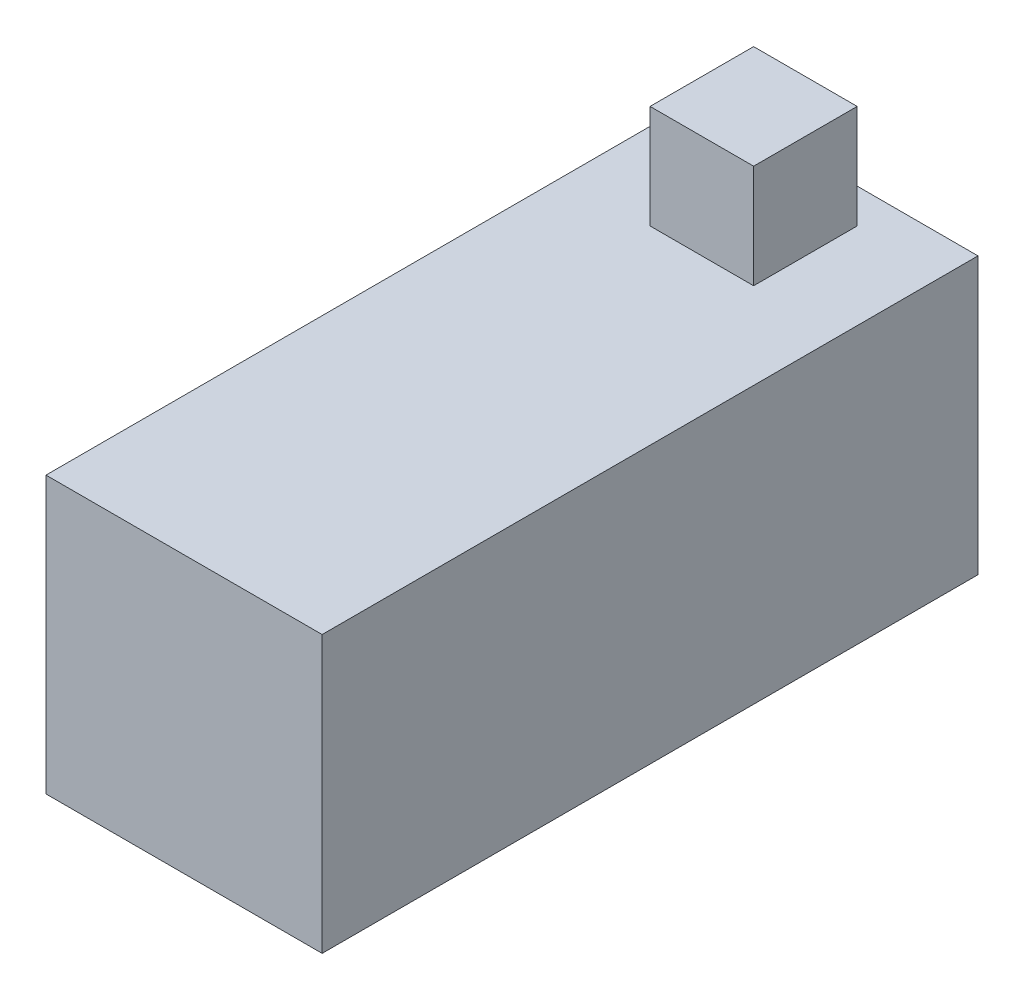
ISO-10303-21;
HEADER;
FILE_DESCRIPTION(('STEP AP214'),'2;1');
FILE_NAME('part.step','',(''),(''),'','','');
FILE_SCHEMA(('AUTOMOTIVE_DESIGN { 1 0 10303 214 1 1 1 1 }'));
ENDSEC;
DATA;
#1=APPLICATION_CONTEXT('core data for automotive mechanical design processes');
#2=APPLICATION_PROTOCOL_DEFINITION('international standard','automotive_design',2000,#1);
#3=PRODUCT_CONTEXT('',#1,'mechanical');
#4=PRODUCT('Part','Part','',(#3));
#5=PRODUCT_RELATED_PRODUCT_CATEGORY('part','',(#4));
#6=PRODUCT_DEFINITION_FORMATION('','',#4);
#7=PRODUCT_DEFINITION_CONTEXT('part definition',#1,'design');
#8=PRODUCT_DEFINITION('design','',#6,#7);
#9=PRODUCT_DEFINITION_SHAPE('','',#8);
#10=(LENGTH_UNIT() NAMED_UNIT(*) SI_UNIT(.MILLI.,.METRE.));
#11=(NAMED_UNIT(*) PLANE_ANGLE_UNIT() SI_UNIT($,.RADIAN.));
#12=(NAMED_UNIT(*) SI_UNIT($,.STERADIAN.) SOLID_ANGLE_UNIT());
#13=UNCERTAINTY_MEASURE_WITH_UNIT(LENGTH_MEASURE(1.E-05),#10,'distance_accuracy_value','');
#14=(GEOMETRIC_REPRESENTATION_CONTEXT(3) GLOBAL_UNCERTAINTY_ASSIGNED_CONTEXT((#13)) GLOBAL_UNIT_ASSIGNED_CONTEXT((#10,
#11,#12)) REPRESENTATION_CONTEXT('',''));
#15=CARTESIAN_POINT('',(0.,0.,0.));
#16=DIRECTION('',(0.,0.,1.));
#17=DIRECTION('',(1.,0.,0.));
#18=AXIS2_PLACEMENT_3D('',#15,#16,#17);
#19=CARTESIAN_POINT('',(0.,-8.,9.5));
#20=DIRECTION('',(0.,0.,1.));
#21=DIRECTION('',(1.,0.,0.));
#22=AXIS2_PLACEMENT_3D('',#19,#20,#21);
#23=PLANE('',#22);
#24=DIRECTION('',(1.,0.,0.));
#25=VECTOR('',#24,1.);
#26=CARTESIAN_POINT('',(0.,0.,9.5));
#27=LINE('',#26,#25);
#28=CARTESIAN_POINT('',(-4.,0.,9.5));
#29=VERTEX_POINT('',#28);
#30=CARTESIAN_POINT('',(4.,0.,9.5));
#31=VERTEX_POINT('',#30);
#32=EDGE_CURVE('E138',#29,#31,#27,.T.);
#33=ORIENTED_EDGE('',*,*,#32,.F.);
#34=DIRECTION('',(0.,1.,0.));
#35=VECTOR('',#34,1.);
#36=CARTESIAN_POINT('',(-4.,-8.,9.5));
#37=LINE('',#36,#35);
#38=CARTESIAN_POINT('',(-4.,-8.,9.5));
#39=VERTEX_POINT('',#38);
#40=EDGE_CURVE('E11',#39,#29,#37,.T.);
#41=ORIENTED_EDGE('',*,*,#40,.F.);
#42=DIRECTION('',(1.,0.,0.));
#43=VECTOR('',#42,1.);
#44=CARTESIAN_POINT('',(0.,-8.,9.5));
#45=LINE('',#44,#43);
#46=CARTESIAN_POINT('',(4.,-8.,9.5));
#47=VERTEX_POINT('',#46);
#48=EDGE_CURVE('E179',#39,#47,#45,.T.);
#49=ORIENTED_EDGE('',*,*,#48,.T.);
#50=DIRECTION('',(0.,1.,0.));
#51=VECTOR('',#50,1.);
#52=CARTESIAN_POINT('',(4.,-8.,9.5));
#53=LINE('',#52,#51);
#54=EDGE_CURVE('E56',#47,#31,#53,.T.);
#55=ORIENTED_EDGE('',*,*,#54,.T.);
#56=EDGE_LOOP('',(#33,#41,#49,#55));
#57=FACE_BOUND('',#56,.T.);
#58=ADVANCED_FACE('F53',(#57),#23,.T.);
#59=CARTESIAN_POINT('',(-4.,-8.,0.));
#60=DIRECTION('',(1.,0.,0.));
#61=DIRECTION('',(0.,0.,-1.));
#62=AXIS2_PLACEMENT_3D('',#59,#60,#61);
#63=PLANE('',#62);
#64=DIRECTION('',(0.,0.,-1.));
#65=VECTOR('',#64,1.);
#66=CARTESIAN_POINT('',(-4.,0.,0.));
#67=LINE('',#66,#65);
#68=CARTESIAN_POINT('',(-4.,0.,-9.5));
#69=VERTEX_POINT('',#68);
#70=EDGE_CURVE('E183',#29,#69,#67,.T.);
#71=ORIENTED_EDGE('',*,*,#70,.T.);
#72=DIRECTION('',(0.,1.,0.));
#73=VECTOR('',#72,1.);
#74=CARTESIAN_POINT('',(-4.,-8.,-9.5));
#75=LINE('',#74,#73);
#76=CARTESIAN_POINT('',(-4.,-8.,-9.5));
#77=VERTEX_POINT('',#76);
#78=EDGE_CURVE('E62',#77,#69,#75,.T.);
#79=ORIENTED_EDGE('',*,*,#78,.F.);
#80=DIRECTION('',(0.,0.,-1.));
#81=VECTOR('',#80,1.);
#82=CARTESIAN_POINT('',(-4.,-8.,0.));
#83=LINE('',#82,#81);
#84=EDGE_CURVE('E189',#39,#77,#83,.T.);
#85=ORIENTED_EDGE('',*,*,#84,.F.);
#86=ORIENTED_EDGE('',*,*,#40,.T.);
#87=EDGE_LOOP('',(#71,#79,#85,#86));
#88=FACE_BOUND('',#87,.T.);
#89=ADVANCED_FACE('F217',(#88),#63,.F.);
#90=CARTESIAN_POINT('',(0.,-8.,-9.5));
#91=DIRECTION('',(0.,0.,1.));
#92=DIRECTION('',(1.,0.,0.));
#93=AXIS2_PLACEMENT_3D('',#90,#91,#92);
#94=PLANE('',#93);
#95=CARTESIAN_POINT('',(0.,-4.,-9.5));
#96=DIRECTION('',(0.,0.,-1.));
#97=DIRECTION('',(-1.,0.,0.));
#98=AXIS2_PLACEMENT_3D('',#95,#96,#97);
#99=CIRCLE('',#98,3.5);
#100=CARTESIAN_POINT('',(-3.5,-4.,-9.5));
#101=VERTEX_POINT('',#100);
#102=EDGE_CURVE('E248',#101,#101,#99,.T.);
#103=ORIENTED_EDGE('',*,*,#102,.F.);
#104=EDGE_LOOP('',(#103));
#105=FACE_BOUND('',#104,.T.);
#106=DIRECTION('',(1.,0.,0.));
#107=VECTOR('',#106,1.);
#108=CARTESIAN_POINT('',(0.,0.,-9.5));
#109=LINE('',#108,#107);
#110=CARTESIAN_POINT('',(4.,0.,-9.5));
#111=VERTEX_POINT('',#110);
#112=EDGE_CURVE('E199',#69,#111,#109,.T.);
#113=ORIENTED_EDGE('',*,*,#112,.T.);
#114=DIRECTION('',(0.,1.,0.));
#115=VECTOR('',#114,1.);
#116=CARTESIAN_POINT('',(4.,-8.,-9.5));
#117=LINE('',#116,#115);
#118=CARTESIAN_POINT('',(4.,-8.,-9.5));
#119=VERTEX_POINT('',#118);
#120=EDGE_CURVE('E207',#119,#111,#117,.T.);
#121=ORIENTED_EDGE('',*,*,#120,.F.);
#122=DIRECTION('',(1.,0.,0.));
#123=VECTOR('',#122,1.);
#124=CARTESIAN_POINT('',(0.,-8.,-9.5));
#125=LINE('',#124,#123);
#126=EDGE_CURVE('E186',#77,#119,#125,.T.);
#127=ORIENTED_EDGE('',*,*,#126,.F.);
#128=ORIENTED_EDGE('',*,*,#78,.T.);
#129=EDGE_LOOP('',(#113,#121,#127,#128));
#130=FACE_BOUND('',#129,.T.);
#131=ADVANCED_FACE('F220',(#105,#130),#94,.F.);
#132=CARTESIAN_POINT('',(4.,-8.,0.));
#133=DIRECTION('',(1.,0.,0.));
#134=DIRECTION('',(0.,0.,-1.));
#135=AXIS2_PLACEMENT_3D('',#132,#133,#134);
#136=PLANE('',#135);
#137=DIRECTION('',(0.,0.,-1.));
#138=VECTOR('',#137,1.);
#139=CARTESIAN_POINT('',(4.,0.,0.));
#140=LINE('',#139,#138);
#141=EDGE_CURVE('E195',#31,#111,#140,.T.);
#142=ORIENTED_EDGE('',*,*,#141,.F.);
#143=ORIENTED_EDGE('',*,*,#54,.F.);
#144=DIRECTION('',(0.,0.,-1.));
#145=VECTOR('',#144,1.);
#146=CARTESIAN_POINT('',(4.,-8.,0.));
#147=LINE('',#146,#145);
#148=EDGE_CURVE('E182',#47,#119,#147,.T.);
#149=ORIENTED_EDGE('',*,*,#148,.T.);
#150=ORIENTED_EDGE('',*,*,#120,.T.);
#151=EDGE_LOOP('',(#142,#143,#149,#150));
#152=FACE_BOUND('',#151,.T.);
#153=ADVANCED_FACE('F212',(#152),#136,.T.);
#154=CARTESIAN_POINT('',(0.,-8.,0.));
#155=DIRECTION('',(0.,1.,0.));
#156=DIRECTION('',(0.,0.,1.));
#157=AXIS2_PLACEMENT_3D('',#154,#155,#156);
#158=PLANE('',#157);
#159=ORIENTED_EDGE('',*,*,#48,.F.);
#160=ORIENTED_EDGE('',*,*,#84,.T.);
#161=ORIENTED_EDGE('',*,*,#126,.T.);
#162=ORIENTED_EDGE('',*,*,#148,.F.);
#163=EDGE_LOOP('',(#159,#160,#161,#162));
#164=FACE_BOUND('',#163,.T.);
#165=ADVANCED_FACE('F222',(#164),#158,.F.);
#166=CARTESIAN_POINT('',(0.,0.,0.));
#167=DIRECTION('',(0.,1.,0.));
#168=DIRECTION('',(0.,0.,1.));
#169=AXIS2_PLACEMENT_3D('',#166,#167,#168);
#170=PLANE('',#169);
#171=DIRECTION('',(0.,0.,1.));
#172=VECTOR('',#171,1.);
#173=CARTESIAN_POINT('',(1.5,0.,0.));
#174=LINE('',#173,#172);
#175=CARTESIAN_POINT('',(1.5,0.,-8.5));
#176=VERTEX_POINT('',#175);
#177=CARTESIAN_POINT('',(1.5,0.,-5.5));
#178=VERTEX_POINT('',#177);
#179=EDGE_CURVE('E132',#176,#178,#174,.T.);
#180=ORIENTED_EDGE('',*,*,#179,.T.);
#181=DIRECTION('',(1.,0.,0.));
#182=VECTOR('',#181,1.);
#183=CARTESIAN_POINT('',(0.,0.,-5.5));
#184=LINE('',#183,#182);
#185=CARTESIAN_POINT('',(-1.5,0.,-5.5));
#186=VERTEX_POINT('',#185);
#187=EDGE_CURVE('E148',#186,#178,#184,.T.);
#188=ORIENTED_EDGE('',*,*,#187,.F.);
#189=DIRECTION('',(0.,0.,1.));
#190=VECTOR('',#189,1.);
#191=CARTESIAN_POINT('',(-1.5,0.,0.));
#192=LINE('',#191,#190);
#193=CARTESIAN_POINT('',(-1.5,0.,-8.5));
#194=VERTEX_POINT('',#193);
#195=EDGE_CURVE('E168',#194,#186,#192,.T.);
#196=ORIENTED_EDGE('',*,*,#195,.F.);
#197=DIRECTION('',(1.,0.,0.));
#198=VECTOR('',#197,1.);
#199=CARTESIAN_POINT('',(0.,0.,-8.5));
#200=LINE('',#199,#198);
#201=EDGE_CURVE('E164',#194,#176,#200,.T.);
#202=ORIENTED_EDGE('',*,*,#201,.T.);
#203=EDGE_LOOP('',(#180,#188,#196,#202));
#204=FACE_BOUND('',#203,.T.);
#205=ORIENTED_EDGE('',*,*,#32,.T.);
#206=ORIENTED_EDGE('',*,*,#141,.T.);
#207=ORIENTED_EDGE('',*,*,#112,.F.);
#208=ORIENTED_EDGE('',*,*,#70,.F.);
#209=EDGE_LOOP('',(#205,#206,#207,#208));
#210=FACE_BOUND('',#209,.T.);
#211=ADVANCED_FACE('F215',(#204,#210),#170,.T.);
#212=CARTESIAN_POINT('',(1.5,3.,0.));
#213=DIRECTION('',(1.,0.,0.));
#214=DIRECTION('',(0.,0.,-1.));
#215=AXIS2_PLACEMENT_3D('',#212,#213,#214);
#216=PLANE('',#215);
#217=ORIENTED_EDGE('',*,*,#179,.F.);
#218=DIRECTION('',(0.,-1.,0.));
#219=VECTOR('',#218,1.);
#220=CARTESIAN_POINT('',(1.5,3.,-8.5));
#221=LINE('',#220,#219);
#222=CARTESIAN_POINT('',(1.5,3.,-8.5));
#223=VERTEX_POINT('',#222);
#224=EDGE_CURVE('E127',#223,#176,#221,.T.);
#225=ORIENTED_EDGE('',*,*,#224,.F.);
#226=DIRECTION('',(0.,0.,1.));
#227=VECTOR('',#226,1.);
#228=CARTESIAN_POINT('',(1.5,3.,0.));
#229=LINE('',#228,#227);
#230=CARTESIAN_POINT('',(1.5,3.,-5.5));
#231=VERTEX_POINT('',#230);
#232=EDGE_CURVE('E130',#223,#231,#229,.T.);
#233=ORIENTED_EDGE('',*,*,#232,.T.);
#234=DIRECTION('',(0.,-1.,0.));
#235=VECTOR('',#234,1.);
#236=CARTESIAN_POINT('',(1.5,3.,-5.5));
#237=LINE('',#236,#235);
#238=EDGE_CURVE('E161',#231,#178,#237,.T.);
#239=ORIENTED_EDGE('',*,*,#238,.T.);
#240=EDGE_LOOP('',(#217,#225,#233,#239));
#241=FACE_BOUND('',#240,.T.);
#242=ADVANCED_FACE('F129',(#241),#216,.T.);
#243=CARTESIAN_POINT('',(0.,3.,-8.5));
#244=DIRECTION('',(0.,0.,-1.));
#245=DIRECTION('',(-1.,0.,0.));
#246=AXIS2_PLACEMENT_3D('',#243,#244,#245);
#247=PLANE('',#246);
#248=ORIENTED_EDGE('',*,*,#201,.F.);
#249=DIRECTION('',(0.,-1.,0.));
#250=VECTOR('',#249,1.);
#251=CARTESIAN_POINT('',(-1.5,3.,-8.5));
#252=LINE('',#251,#250);
#253=CARTESIAN_POINT('',(-1.5,3.,-8.5));
#254=VERTEX_POINT('',#253);
#255=EDGE_CURVE('E139',#254,#194,#252,.T.);
#256=ORIENTED_EDGE('',*,*,#255,.F.);
#257=DIRECTION('',(1.,0.,0.));
#258=VECTOR('',#257,1.);
#259=CARTESIAN_POINT('',(0.,3.,-8.5));
#260=LINE('',#259,#258);
#261=EDGE_CURVE('E144',#254,#223,#260,.T.);
#262=ORIENTED_EDGE('',*,*,#261,.T.);
#263=ORIENTED_EDGE('',*,*,#224,.T.);
#264=EDGE_LOOP('',(#248,#256,#262,#263));
#265=FACE_BOUND('',#264,.T.);
#266=ADVANCED_FACE('F150',(#265),#247,.T.);
#267=CARTESIAN_POINT('',(-1.5,3.,0.));
#268=DIRECTION('',(1.,0.,0.));
#269=DIRECTION('',(0.,0.,-1.));
#270=AXIS2_PLACEMENT_3D('',#267,#268,#269);
#271=PLANE('',#270);
#272=ORIENTED_EDGE('',*,*,#195,.T.);
#273=DIRECTION('',(0.,-1.,0.));
#274=VECTOR('',#273,1.);
#275=CARTESIAN_POINT('',(-1.5,3.,-5.5));
#276=LINE('',#275,#274);
#277=CARTESIAN_POINT('',(-1.5,3.,-5.5));
#278=VERTEX_POINT('',#277);
#279=EDGE_CURVE('E70',#278,#186,#276,.T.);
#280=ORIENTED_EDGE('',*,*,#279,.F.);
#281=DIRECTION('',(0.,0.,1.));
#282=VECTOR('',#281,1.);
#283=CARTESIAN_POINT('',(-1.5,3.,0.));
#284=LINE('',#283,#282);
#285=EDGE_CURVE('E153',#254,#278,#284,.T.);
#286=ORIENTED_EDGE('',*,*,#285,.F.);
#287=ORIENTED_EDGE('',*,*,#255,.T.);
#288=EDGE_LOOP('',(#272,#280,#286,#287));
#289=FACE_BOUND('',#288,.T.);
#290=ADVANCED_FACE('F270',(#289),#271,.F.);
#291=CARTESIAN_POINT('',(0.,3.,-5.5));
#292=DIRECTION('',(0.,0.,-1.));
#293=DIRECTION('',(-1.,0.,0.));
#294=AXIS2_PLACEMENT_3D('',#291,#292,#293);
#295=PLANE('',#294);
#296=ORIENTED_EDGE('',*,*,#187,.T.);
#297=ORIENTED_EDGE('',*,*,#238,.F.);
#298=DIRECTION('',(1.,0.,0.));
#299=VECTOR('',#298,1.);
#300=CARTESIAN_POINT('',(0.,3.,-5.5));
#301=LINE('',#300,#299);
#302=EDGE_CURVE('E145',#278,#231,#301,.T.);
#303=ORIENTED_EDGE('',*,*,#302,.F.);
#304=ORIENTED_EDGE('',*,*,#279,.T.);
#305=EDGE_LOOP('',(#296,#297,#303,#304));
#306=FACE_BOUND('',#305,.T.);
#307=ADVANCED_FACE('F265',(#306),#295,.F.);
#308=CARTESIAN_POINT('',(0.,3.,0.));
#309=DIRECTION('',(0.,1.,0.));
#310=DIRECTION('',(0.,0.,1.));
#311=AXIS2_PLACEMENT_3D('',#308,#309,#310);
#312=PLANE('',#311);
#313=ORIENTED_EDGE('',*,*,#232,.F.);
#314=ORIENTED_EDGE('',*,*,#261,.F.);
#315=ORIENTED_EDGE('',*,*,#285,.T.);
#316=ORIENTED_EDGE('',*,*,#302,.T.);
#317=EDGE_LOOP('',(#313,#314,#315,#316));
#318=FACE_BOUND('',#317,.T.);
#319=ADVANCED_FACE('F143',(#318),#312,.T.);
#320=CARTESIAN_POINT('',(0.,-4.,-8.5));
#321=DIRECTION('',(0.,0.,-1.));
#322=DIRECTION('',(-1.,0.,0.));
#323=AXIS2_PLACEMENT_3D('',#320,#321,#322);
#324=CYLINDRICAL_SURFACE('',#323,3.5);
#325=CARTESIAN_POINT('',(0.,-4.,-8.5));
#326=DIRECTION('',(0.,0.,-1.));
#327=DIRECTION('',(-1.,0.,0.));
#328=AXIS2_PLACEMENT_3D('',#325,#326,#327);
#329=CIRCLE('',#328,3.5);
#330=CARTESIAN_POINT('',(-3.5,-4.,-8.5));
#331=VERTEX_POINT('',#330);
#332=EDGE_CURVE('E165',#331,#331,#329,.T.);
#333=ORIENTED_EDGE('',*,*,#332,.F.);
#334=EDGE_LOOP('',(#333));
#335=FACE_BOUND('',#334,.T.);
#336=ORIENTED_EDGE('',*,*,#102,.T.);
#337=EDGE_LOOP('',(#336));
#338=FACE_BOUND('',#337,.T.);
#339=ADVANCED_FACE('F258',(#335,#338),#324,.F.);
#340=CARTESIAN_POINT('',(0.,-4.,-8.5));
#341=DIRECTION('',(0.,0.,-1.));
#342=DIRECTION('',(-1.,0.,0.));
#343=AXIS2_PLACEMENT_3D('',#340,#341,#342);
#344=PLANE('',#343);
#345=ORIENTED_EDGE('',*,*,#332,.T.);
#346=EDGE_LOOP('',(#345));
#347=FACE_BOUND('',#346,.T.);
#348=ADVANCED_FACE('F256',(#347),#344,.T.);
#349=CLOSED_SHELL('',(#58,#89,#131,#153,#165,#211,#242,#266,#290,#307,#319,#339,#348));
#350=MANIFOLD_SOLID_BREP('B2',#349);
#351=ADVANCED_BREP_SHAPE_REPRESENTATION('',(#18,#350),#14);
#352=SHAPE_DEFINITION_REPRESENTATION(#9,#351);
ENDSEC;
END-ISO-10303-21;
